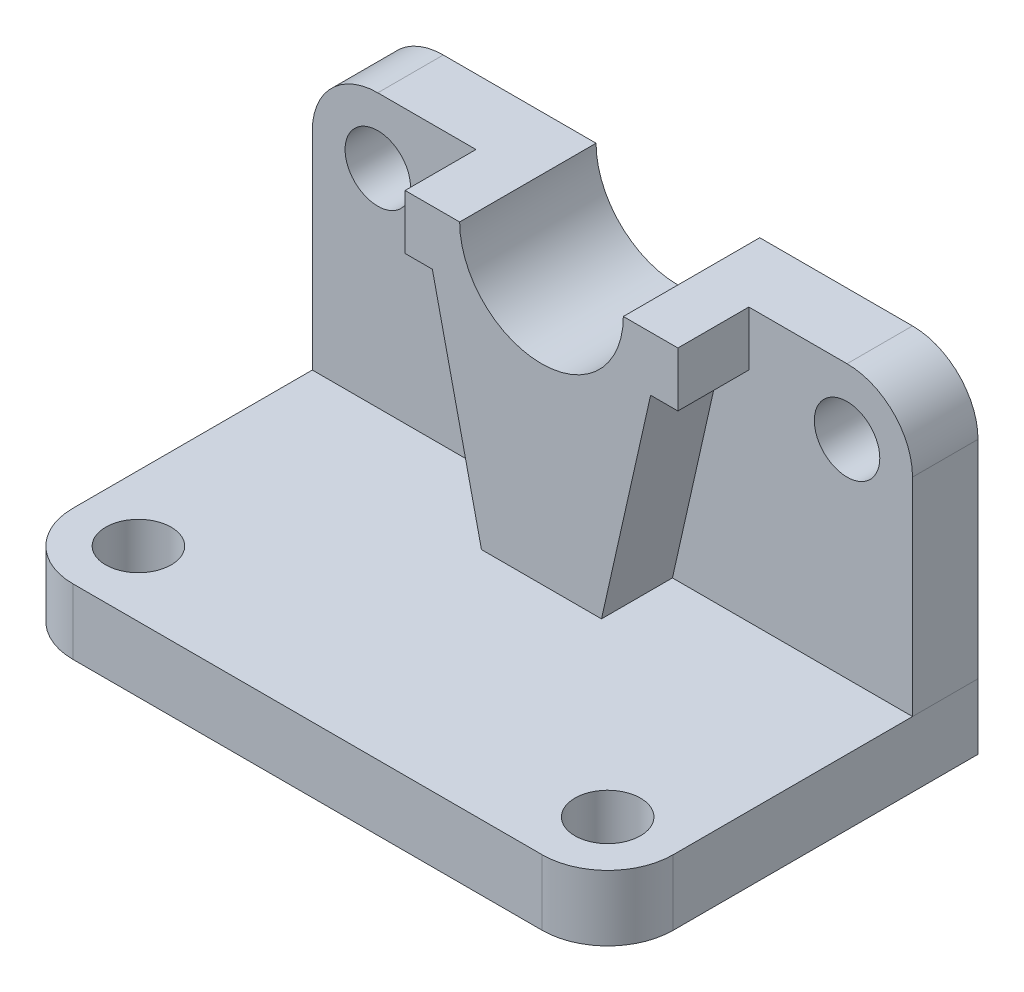
ISO-10303-21;
HEADER;
FILE_DESCRIPTION(('STEP AP214'),'2;1');
FILE_NAME('part.step','',(''),(''),'','','');
FILE_SCHEMA(('AUTOMOTIVE_DESIGN { 1 0 10303 214 1 1 1 1 }'));
ENDSEC;
DATA;
#1=APPLICATION_CONTEXT('core data for automotive mechanical design processes');
#2=APPLICATION_PROTOCOL_DEFINITION('international standard','automotive_design',2000,#1);
#3=PRODUCT_CONTEXT('',#1,'mechanical');
#4=PRODUCT('Part','Part','',(#3));
#5=PRODUCT_RELATED_PRODUCT_CATEGORY('part','',(#4));
#6=PRODUCT_DEFINITION_FORMATION('','',#4);
#7=PRODUCT_DEFINITION_CONTEXT('part definition',#1,'design');
#8=PRODUCT_DEFINITION('design','',#6,#7);
#9=PRODUCT_DEFINITION_SHAPE('','',#8);
#10=(LENGTH_UNIT() NAMED_UNIT(*) SI_UNIT(.MILLI.,.METRE.));
#11=(NAMED_UNIT(*) PLANE_ANGLE_UNIT() SI_UNIT($,.RADIAN.));
#12=(NAMED_UNIT(*) SI_UNIT($,.STERADIAN.) SOLID_ANGLE_UNIT());
#13=UNCERTAINTY_MEASURE_WITH_UNIT(LENGTH_MEASURE(1.E-05),#10,'distance_accuracy_value','');
#14=(GEOMETRIC_REPRESENTATION_CONTEXT(3) GLOBAL_UNCERTAINTY_ASSIGNED_CONTEXT((#13)) GLOBAL_UNIT_ASSIGNED_CONTEXT((#10,
#11,#12)) REPRESENTATION_CONTEXT('',''));
#15=CARTESIAN_POINT('',(0.,0.,0.));
#16=DIRECTION('',(0.,0.,1.));
#17=DIRECTION('',(1.,0.,0.));
#18=AXIS2_PLACEMENT_3D('',#15,#16,#17);
#19=CARTESIAN_POINT('',(0.,62.,12.));
#20=DIRECTION('',(0.,1.,0.));
#21=DIRECTION('',(0.,0.,1.));
#22=AXIS2_PLACEMENT_3D('',#19,#20,#21);
#23=PLANE('',#22);
#24=DIRECTION('',(1.,0.,0.));
#25=VECTOR('',#24,1.);
#26=CARTESIAN_POINT('',(0.,62.,0.));
#27=LINE('',#26,#25);
#28=CARTESIAN_POINT('',(-98.,62.,0.));
#29=VERTEX_POINT('',#28);
#30=CARTESIAN_POINT('',(-70.,62.,0.));
#31=VERTEX_POINT('',#30);
#32=EDGE_CURVE('E318',#29,#31,#27,.T.);
#33=ORIENTED_EDGE('',*,*,#32,.F.);
#34=DIRECTION('',(0.,0.,-1.));
#35=VECTOR('',#34,1.);
#36=CARTESIAN_POINT('',(-98.,62.,12.));
#37=LINE('',#36,#35);
#38=CARTESIAN_POINT('',(-98.,62.,12.));
#39=VERTEX_POINT('',#38);
#40=EDGE_CURVE('E13',#39,#29,#37,.T.);
#41=ORIENTED_EDGE('',*,*,#40,.F.);
#42=DIRECTION('',(1.,0.,0.));
#43=VECTOR('',#42,1.);
#44=CARTESIAN_POINT('',(0.,62.,12.));
#45=LINE('',#44,#43);
#46=CARTESIAN_POINT('',(-80.,62.,12.));
#47=VERTEX_POINT('',#46);
#48=EDGE_CURVE('E301',#39,#47,#45,.T.);
#49=ORIENTED_EDGE('',*,*,#48,.T.);
#50=DIRECTION('',(0.,0.,-1.));
#51=VECTOR('',#50,1.);
#52=CARTESIAN_POINT('',(-80.,62.,25.));
#53=LINE('',#52,#51);
#54=CARTESIAN_POINT('',(-80.,62.,25.));
#55=VERTEX_POINT('',#54);
#56=EDGE_CURVE('E292',#55,#47,#53,.T.);
#57=ORIENTED_EDGE('',*,*,#56,.F.);
#58=DIRECTION('',(1.,0.,0.));
#59=VECTOR('',#58,1.);
#60=CARTESIAN_POINT('',(0.,62.,25.));
#61=LINE('',#60,#59);
#62=CARTESIAN_POINT('',(-70.,62.,25.));
#63=VERTEX_POINT('',#62);
#64=EDGE_CURVE('E248',#55,#63,#61,.T.);
#65=ORIENTED_EDGE('',*,*,#64,.T.);
#66=DIRECTION('',(0.,0.,-1.));
#67=VECTOR('',#66,1.);
#68=CARTESIAN_POINT('',(-70.,62.,25.));
#69=LINE('',#68,#67);
#70=EDGE_CURVE('E294',#63,#31,#69,.T.);
#71=ORIENTED_EDGE('',*,*,#70,.T.);
#72=EDGE_LOOP('',(#33,#41,#49,#57,#65,#71));
#73=FACE_BOUND('',#72,.T.);
#74=ADVANCED_FACE('F93',(#73),#23,.T.);
#75=CARTESIAN_POINT('',(-98.,50.,12.));
#76=DIRECTION('',(0.,0.,-1.));
#77=DIRECTION('',(-1.,0.,0.));
#78=AXIS2_PLACEMENT_3D('',#75,#76,#77);
#79=CYLINDRICAL_SURFACE('',#78,12.);
#80=CARTESIAN_POINT('',(-98.,50.,0.));
#81=DIRECTION('',(0.,0.,1.));
#82=DIRECTION('',(1.,0.,0.));
#83=AXIS2_PLACEMENT_3D('',#80,#81,#82);
#84=CIRCLE('',#83,12.);
#85=CARTESIAN_POINT('',(-110.,50.,0.));
#86=VERTEX_POINT('',#85);
#87=EDGE_CURVE('E320',#29,#86,#84,.T.);
#88=ORIENTED_EDGE('',*,*,#87,.T.);
#89=DIRECTION('',(0.,0.,-1.));
#90=VECTOR('',#89,1.);
#91=CARTESIAN_POINT('',(-110.,50.,12.));
#92=LINE('',#91,#90);
#93=CARTESIAN_POINT('',(-110.,50.,12.));
#94=VERTEX_POINT('',#93);
#95=EDGE_CURVE('E102',#94,#86,#92,.T.);
#96=ORIENTED_EDGE('',*,*,#95,.F.);
#97=CARTESIAN_POINT('',(-98.,50.,12.));
#98=DIRECTION('',(0.,0.,1.));
#99=DIRECTION('',(1.,0.,0.));
#100=AXIS2_PLACEMENT_3D('',#97,#98,#99);
#101=CIRCLE('',#100,12.);
#102=EDGE_CURVE('E304',#39,#94,#101,.T.);
#103=ORIENTED_EDGE('',*,*,#102,.F.);
#104=ORIENTED_EDGE('',*,*,#40,.T.);
#105=EDGE_LOOP('',(#88,#96,#103,#104));
#106=FACE_BOUND('',#105,.T.);
#107=ADVANCED_FACE('F364',(#106),#79,.T.);
#108=CARTESIAN_POINT('',(-110.,0.,12.));
#109=DIRECTION('',(-1.,0.,0.));
#110=DIRECTION('',(0.,0.,1.));
#111=AXIS2_PLACEMENT_3D('',#108,#109,#110);
#112=PLANE('',#111);
#113=DIRECTION('',(0.,1.,0.));
#114=VECTOR('',#113,1.);
#115=CARTESIAN_POINT('',(-110.,0.,0.));
#116=LINE('',#115,#114);
#117=CARTESIAN_POINT('',(-110.,12.,0.));
#118=VERTEX_POINT('',#117);
#119=EDGE_CURVE('E322',#118,#86,#116,.T.);
#120=ORIENTED_EDGE('',*,*,#119,.F.);
#121=DIRECTION('',(0.,0.,-1.));
#122=VECTOR('',#121,1.);
#123=CARTESIAN_POINT('',(-110.,12.,12.));
#124=LINE('',#123,#122);
#125=CARTESIAN_POINT('',(-110.,12.,12.));
#126=VERTEX_POINT('',#125);
#127=EDGE_CURVE('E110',#126,#118,#124,.T.);
#128=ORIENTED_EDGE('',*,*,#127,.F.);
#129=DIRECTION('',(0.,1.,0.));
#130=VECTOR('',#129,1.);
#131=CARTESIAN_POINT('',(-110.,0.,12.));
#132=LINE('',#131,#130);
#133=EDGE_CURVE('E306',#126,#94,#132,.T.);
#134=ORIENTED_EDGE('',*,*,#133,.T.);
#135=ORIENTED_EDGE('',*,*,#95,.T.);
#136=EDGE_LOOP('',(#120,#128,#134,#135));
#137=FACE_BOUND('',#136,.T.);
#138=ADVANCED_FACE('F370',(#137),#112,.T.);
#139=CARTESIAN_POINT('',(0.,12.,12.));
#140=DIRECTION('',(0.,-1.,0.));
#141=DIRECTION('',(0.,0.,-1.));
#142=AXIS2_PLACEMENT_3D('',#139,#140,#141);
#143=PLANE('',#142);
#144=DIRECTION('',(-1.,0.,0.));
#145=VECTOR('',#144,1.);
#146=CARTESIAN_POINT('',(0.,12.,0.));
#147=LINE('',#146,#145);
#148=CARTESIAN_POINT('',(0.,12.,0.));
#149=VERTEX_POINT('',#148);
#150=EDGE_CURVE('E302',#149,#118,#147,.T.);
#151=ORIENTED_EDGE('',*,*,#150,.F.);
#152=DIRECTION('',(0.,0.,-1.));
#153=VECTOR('',#152,1.);
#154=CARTESIAN_POINT('',(0.,12.,12.));
#155=LINE('',#154,#153);
#156=CARTESIAN_POINT('',(0.,12.,12.));
#157=VERTEX_POINT('',#156);
#158=EDGE_CURVE('E241',#157,#149,#155,.T.);
#159=ORIENTED_EDGE('',*,*,#158,.F.);
#160=DIRECTION('',(1.,0.,0.));
#161=VECTOR('',#160,1.);
#162=CARTESIAN_POINT('',(0.,12.,12.));
#163=LINE('',#162,#161);
#164=CARTESIAN_POINT('',(-44.,12.,12.));
#165=VERTEX_POINT('',#164);
#166=EDGE_CURVE('E227',#165,#157,#163,.T.);
#167=ORIENTED_EDGE('',*,*,#166,.F.);
#168=DIRECTION('',(0.,0.,-1.));
#169=VECTOR('',#168,1.);
#170=CARTESIAN_POINT('',(-44.,12.,25.));
#171=LINE('',#170,#169);
#172=CARTESIAN_POINT('',(-44.,12.,25.));
#173=VERTEX_POINT('',#172);
#174=EDGE_CURVE('E280',#173,#165,#171,.T.);
#175=ORIENTED_EDGE('',*,*,#174,.F.);
#176=DIRECTION('',(1.,0.,0.));
#177=VECTOR('',#176,1.);
#178=CARTESIAN_POINT('',(0.,12.,25.));
#179=LINE('',#178,#177);
#180=CARTESIAN_POINT('',(-66.,12.,25.));
#181=VERTEX_POINT('',#180);
#182=EDGE_CURVE('E257',#181,#173,#179,.T.);
#183=ORIENTED_EDGE('',*,*,#182,.F.);
#184=DIRECTION('',(0.,0.,-1.));
#185=VECTOR('',#184,1.);
#186=CARTESIAN_POINT('',(-66.,12.,25.));
#187=LINE('',#186,#185);
#188=CARTESIAN_POINT('',(-66.,12.,12.));
#189=VERTEX_POINT('',#188);
#190=EDGE_CURVE('E283',#181,#189,#187,.T.);
#191=ORIENTED_EDGE('',*,*,#190,.T.);
#192=DIRECTION('',(-1.,0.,0.));
#193=VECTOR('',#192,1.);
#194=CARTESIAN_POINT('',(0.,12.,12.));
#195=LINE('',#194,#193);
#196=EDGE_CURVE('E308',#189,#126,#195,.T.);
#197=ORIENTED_EDGE('',*,*,#196,.T.);
#198=ORIENTED_EDGE('',*,*,#127,.T.);
#199=EDGE_LOOP('',(#151,#159,#167,#175,#183,#191,#197,#198));
#200=FACE_BOUND('',#199,.T.);
#201=ADVANCED_FACE('F331',(#200),#143,.T.);
#202=CARTESIAN_POINT('',(-98.,50.,12.));
#203=DIRECTION('',(0.,0.,-1.));
#204=DIRECTION('',(-1.,0.,0.));
#205=AXIS2_PLACEMENT_3D('',#202,#203,#204);
#206=CYLINDRICAL_SURFACE('',#205,6.);
#207=CARTESIAN_POINT('',(-98.,50.,12.));
#208=DIRECTION('',(0.,0.,1.));
#209=DIRECTION('',(1.,0.,0.));
#210=AXIS2_PLACEMENT_3D('',#207,#208,#209);
#211=CIRCLE('',#210,6.);
#212=CARTESIAN_POINT('',(-92.,50.,12.));
#213=VERTEX_POINT('',#212);
#214=EDGE_CURVE('E298',#213,#213,#211,.T.);
#215=ORIENTED_EDGE('',*,*,#214,.T.);
#216=EDGE_LOOP('',(#215));
#217=FACE_BOUND('',#216,.T.);
#218=CARTESIAN_POINT('',(-98.,50.,0.));
#219=DIRECTION('',(0.,0.,1.));
#220=DIRECTION('',(1.,0.,0.));
#221=AXIS2_PLACEMENT_3D('',#218,#219,#220);
#222=CIRCLE('',#221,6.);
#223=CARTESIAN_POINT('',(-92.,50.,0.));
#224=VERTEX_POINT('',#223);
#225=EDGE_CURVE('E297',#224,#224,#222,.T.);
#226=ORIENTED_EDGE('',*,*,#225,.F.);
#227=EDGE_LOOP('',(#226));
#228=FACE_BOUND('',#227,.T.);
#229=ADVANCED_FACE('F95',(#217,#228),#206,.F.);
#230=CARTESIAN_POINT('',(0.,0.,12.));
#231=DIRECTION('',(0.,0.,1.));
#232=DIRECTION('',(1.,0.,0.));
#233=AXIS2_PLACEMENT_3D('',#230,#231,#232);
#234=PLANE('',#233);
#235=ORIENTED_EDGE('',*,*,#214,.F.);
#236=EDGE_LOOP('',(#235));
#237=FACE_BOUND('',#236,.T.);
#238=ORIENTED_EDGE('',*,*,#48,.F.);
#239=ORIENTED_EDGE('',*,*,#102,.T.);
#240=ORIENTED_EDGE('',*,*,#133,.F.);
#241=ORIENTED_EDGE('',*,*,#196,.F.);
#242=DIRECTION('',(0.219512195121952,-0.975609756097561,0.));
#243=VECTOR('',#242,1.);
#244=CARTESIAN_POINT('',(-60.2498512790006,-13.5562165377752,12.));
#245=LINE('',#244,#243);
#246=CARTESIAN_POINT('',(-75.,52.,12.));
#247=VERTEX_POINT('',#246);
#248=EDGE_CURVE('E310',#247,#189,#245,.T.);
#249=ORIENTED_EDGE('',*,*,#248,.F.);
#250=DIRECTION('',(1.,0.,0.));
#251=VECTOR('',#250,1.);
#252=CARTESIAN_POINT('',(0.,52.,12.));
#253=LINE('',#252,#251);
#254=CARTESIAN_POINT('',(-80.,52.,12.));
#255=VERTEX_POINT('',#254);
#256=EDGE_CURVE('E312',#255,#247,#253,.T.);
#257=ORIENTED_EDGE('',*,*,#256,.F.);
#258=DIRECTION('',(0.,-1.,0.));
#259=VECTOR('',#258,1.);
#260=CARTESIAN_POINT('',(-80.,0.,12.));
#261=LINE('',#260,#259);
#262=EDGE_CURVE('E314',#47,#255,#261,.T.);
#263=ORIENTED_EDGE('',*,*,#262,.F.);
#264=EDGE_LOOP('',(#238,#239,#240,#241,#249,#257,#263));
#265=FACE_BOUND('',#264,.T.);
#266=ADVANCED_FACE('F380',(#237,#265),#234,.T.);
#267=CARTESIAN_POINT('',(0.,0.,0.));
#268=DIRECTION('',(0.,0.,1.));
#269=DIRECTION('',(1.,0.,0.));
#270=AXIS2_PLACEMENT_3D('',#267,#268,#269);
#271=PLANE('',#270);
#272=ORIENTED_EDGE('',*,*,#225,.T.);
#273=EDGE_LOOP('',(#272));
#274=FACE_BOUND('',#273,.T.);
#275=ORIENTED_EDGE('',*,*,#32,.T.);
#276=CARTESIAN_POINT('',(-55.,62.,0.));
#277=DIRECTION('',(0.,0.,1.));
#278=DIRECTION('',(1.,0.,0.));
#279=AXIS2_PLACEMENT_3D('',#276,#277,#278);
#280=CIRCLE('',#279,15.);
#281=CARTESIAN_POINT('',(-40.,62.,0.));
#282=VERTEX_POINT('',#281);
#283=EDGE_CURVE('E236',#31,#282,#280,.T.);
#284=ORIENTED_EDGE('',*,*,#283,.T.);
#285=DIRECTION('',(1.,0.,0.));
#286=VECTOR('',#285,1.);
#287=CARTESIAN_POINT('',(0.,62.,0.));
#288=LINE('',#287,#286);
#289=CARTESIAN_POINT('',(-12.,62.,0.));
#290=VERTEX_POINT('',#289);
#291=EDGE_CURVE('E239',#282,#290,#288,.T.);
#292=ORIENTED_EDGE('',*,*,#291,.T.);
#293=CARTESIAN_POINT('',(-12.,50.,0.));
#294=DIRECTION('',(0.,0.,1.));
#295=DIRECTION('',(1.,0.,0.));
#296=AXIS2_PLACEMENT_3D('',#293,#294,#295);
#297=CIRCLE('',#296,12.);
#298=CARTESIAN_POINT('',(0.,50.,0.));
#299=VERTEX_POINT('',#298);
#300=EDGE_CURVE('E335',#299,#290,#297,.T.);
#301=ORIENTED_EDGE('',*,*,#300,.F.);
#302=DIRECTION('',(0.,1.,0.));
#303=VECTOR('',#302,1.);
#304=CARTESIAN_POINT('',(0.,0.,0.));
#305=LINE('',#304,#303);
#306=EDGE_CURVE('E235',#149,#299,#305,.T.);
#307=ORIENTED_EDGE('',*,*,#306,.F.);
#308=ORIENTED_EDGE('',*,*,#150,.T.);
#309=ORIENTED_EDGE('',*,*,#119,.T.);
#310=ORIENTED_EDGE('',*,*,#87,.F.);
#311=EDGE_LOOP('',(#275,#284,#292,#301,#307,#308,#309,#310));
#312=FACE_BOUND('',#311,.T.);
#313=CARTESIAN_POINT('',(-12.,50.,0.));
#314=DIRECTION('',(0.,0.,1.));
#315=DIRECTION('',(1.,0.,0.));
#316=AXIS2_PLACEMENT_3D('',#313,#314,#315);
#317=CIRCLE('',#316,6.);
#318=CARTESIAN_POINT('',(-6.,50.,0.));
#319=VERTEX_POINT('',#318);
#320=EDGE_CURVE('E338',#319,#319,#317,.T.);
#321=ORIENTED_EDGE('',*,*,#320,.T.);
#322=EDGE_LOOP('',(#321));
#323=FACE_BOUND('',#322,.T.);
#324=ADVANCED_FACE('F328',(#274,#312,#323),#271,.F.);
#325=CARTESIAN_POINT('',(-55.,62.,25.));
#326=DIRECTION('',(0.,0.,-1.));
#327=DIRECTION('',(-1.,0.,0.));
#328=AXIS2_PLACEMENT_3D('',#325,#326,#327);
#329=CYLINDRICAL_SURFACE('',#328,15.);
#330=ORIENTED_EDGE('',*,*,#283,.F.);
#331=ORIENTED_EDGE('',*,*,#70,.F.);
#332=CARTESIAN_POINT('',(-55.,62.,25.));
#333=DIRECTION('',(0.,0.,1.));
#334=DIRECTION('',(1.,0.,0.));
#335=AXIS2_PLACEMENT_3D('',#332,#333,#334);
#336=CIRCLE('',#335,15.);
#337=CARTESIAN_POINT('',(-40.,62.,25.));
#338=VERTEX_POINT('',#337);
#339=EDGE_CURVE('E245',#63,#338,#336,.T.);
#340=ORIENTED_EDGE('',*,*,#339,.T.);
#341=DIRECTION('',(0.,0.,-1.));
#342=VECTOR('',#341,1.);
#343=CARTESIAN_POINT('',(-40.,62.,25.));
#344=LINE('',#343,#342);
#345=EDGE_CURVE('E267',#338,#282,#344,.T.);
#346=ORIENTED_EDGE('',*,*,#345,.T.);
#347=EDGE_LOOP('',(#330,#331,#340,#346));
#348=FACE_BOUND('',#347,.T.);
#349=ADVANCED_FACE('F379',(#348),#329,.F.);
#350=CARTESIAN_POINT('',(-80.,0.,25.));
#351=DIRECTION('',(1.,0.,0.));
#352=DIRECTION('',(0.,0.,-1.));
#353=AXIS2_PLACEMENT_3D('',#350,#351,#352);
#354=PLANE('',#353);
#355=ORIENTED_EDGE('',*,*,#262,.T.);
#356=DIRECTION('',(0.,0.,-1.));
#357=VECTOR('',#356,1.);
#358=CARTESIAN_POINT('',(-80.,52.,25.));
#359=LINE('',#358,#357);
#360=CARTESIAN_POINT('',(-80.,52.,25.));
#361=VERTEX_POINT('',#360);
#362=EDGE_CURVE('E289',#361,#255,#359,.T.);
#363=ORIENTED_EDGE('',*,*,#362,.F.);
#364=DIRECTION('',(0.,-1.,0.));
#365=VECTOR('',#364,1.);
#366=CARTESIAN_POINT('',(-80.,0.,25.));
#367=LINE('',#366,#365);
#368=EDGE_CURVE('E251',#55,#361,#367,.T.);
#369=ORIENTED_EDGE('',*,*,#368,.F.);
#370=ORIENTED_EDGE('',*,*,#56,.T.);
#371=EDGE_LOOP('',(#355,#363,#369,#370));
#372=FACE_BOUND('',#371,.T.);
#373=ADVANCED_FACE('F387',(#372),#354,.F.);
#374=CARTESIAN_POINT('',(0.,52.,25.));
#375=DIRECTION('',(0.,1.,0.));
#376=DIRECTION('',(0.,0.,1.));
#377=AXIS2_PLACEMENT_3D('',#374,#375,#376);
#378=PLANE('',#377);
#379=ORIENTED_EDGE('',*,*,#256,.T.);
#380=DIRECTION('',(0.,0.,-1.));
#381=VECTOR('',#380,1.);
#382=CARTESIAN_POINT('',(-75.,52.,25.));
#383=LINE('',#382,#381);
#384=CARTESIAN_POINT('',(-75.,52.,25.));
#385=VERTEX_POINT('',#384);
#386=EDGE_CURVE('E286',#385,#247,#383,.T.);
#387=ORIENTED_EDGE('',*,*,#386,.F.);
#388=DIRECTION('',(1.,0.,0.));
#389=VECTOR('',#388,1.);
#390=CARTESIAN_POINT('',(0.,52.,25.));
#391=LINE('',#390,#389);
#392=EDGE_CURVE('E253',#361,#385,#391,.T.);
#393=ORIENTED_EDGE('',*,*,#392,.F.);
#394=ORIENTED_EDGE('',*,*,#362,.T.);
#395=EDGE_LOOP('',(#379,#387,#393,#394));
#396=FACE_BOUND('',#395,.T.);
#397=ADVANCED_FACE('F391',(#396),#378,.F.);
#398=CARTESIAN_POINT('',(-60.2498512790006,-13.5562165377752,25.));
#399=DIRECTION('',(0.975609756097561,0.219512195121952,0.));
#400=DIRECTION('',(-0.219512195121952,0.975609756097561,0.));
#401=AXIS2_PLACEMENT_3D('',#398,#399,#400);
#402=PLANE('',#401);
#403=ORIENTED_EDGE('',*,*,#248,.T.);
#404=ORIENTED_EDGE('',*,*,#190,.F.);
#405=DIRECTION('',(0.219512195121952,-0.975609756097561,0.));
#406=VECTOR('',#405,1.);
#407=CARTESIAN_POINT('',(-60.2498512790006,-13.5562165377752,25.));
#408=LINE('',#407,#406);
#409=EDGE_CURVE('E255',#385,#181,#408,.T.);
#410=ORIENTED_EDGE('',*,*,#409,.F.);
#411=ORIENTED_EDGE('',*,*,#386,.T.);
#412=EDGE_LOOP('',(#403,#404,#410,#411));
#413=FACE_BOUND('',#412,.T.);
#414=ADVANCED_FACE('F395',(#413),#402,.F.);
#415=CARTESIAN_POINT('',(-44.4497323022011,10.0011897679952,25.));
#416=DIRECTION('',(-0.975609756097561,0.219512195121951,0.));
#417=DIRECTION('',(-0.219512195121951,-0.975609756097561,0.));
#418=AXIS2_PLACEMENT_3D('',#415,#416,#417);
#419=PLANE('',#418);
#420=ORIENTED_EDGE('',*,*,#174,.T.);
#421=DIRECTION('',(0.219512195121951,0.975609756097561,0.));
#422=VECTOR('',#421,1.);
#423=CARTESIAN_POINT('',(-44.4497323022011,10.0011897679952,12.));
#424=LINE('',#423,#422);
#425=CARTESIAN_POINT('',(-35.,52.,12.));
#426=VERTEX_POINT('',#425);
#427=EDGE_CURVE('E332',#165,#426,#424,.T.);
#428=ORIENTED_EDGE('',*,*,#427,.T.);
#429=DIRECTION('',(0.,0.,-1.));
#430=VECTOR('',#429,1.);
#431=CARTESIAN_POINT('',(-35.,52.,25.));
#432=LINE('',#431,#430);
#433=CARTESIAN_POINT('',(-35.,52.,25.));
#434=VERTEX_POINT('',#433);
#435=EDGE_CURVE('E277',#434,#426,#432,.T.);
#436=ORIENTED_EDGE('',*,*,#435,.F.);
#437=DIRECTION('',(0.219512195121951,0.975609756097561,0.));
#438=VECTOR('',#437,1.);
#439=CARTESIAN_POINT('',(-44.4497323022011,10.0011897679952,25.));
#440=LINE('',#439,#438);
#441=EDGE_CURVE('E259',#173,#434,#440,.T.);
#442=ORIENTED_EDGE('',*,*,#441,.F.);
#443=EDGE_LOOP('',(#420,#428,#436,#442));
#444=FACE_BOUND('',#443,.T.);
#445=ADVANCED_FACE('F399',(#444),#419,.F.);
#446=CARTESIAN_POINT('',(0.,52.,25.));
#447=DIRECTION('',(0.,1.,0.));
#448=DIRECTION('',(0.,0.,1.));
#449=AXIS2_PLACEMENT_3D('',#446,#447,#448);
#450=PLANE('',#449);
#451=ORIENTED_EDGE('',*,*,#435,.T.);
#452=DIRECTION('',(1.,0.,0.));
#453=VECTOR('',#452,1.);
#454=CARTESIAN_POINT('',(0.,52.,12.));
#455=LINE('',#454,#453);
#456=CARTESIAN_POINT('',(-30.,52.,12.));
#457=VERTEX_POINT('',#456);
#458=EDGE_CURVE('E343',#426,#457,#455,.T.);
#459=ORIENTED_EDGE('',*,*,#458,.T.);
#460=DIRECTION('',(0.,0.,-1.));
#461=VECTOR('',#460,1.);
#462=CARTESIAN_POINT('',(-30.,52.,25.));
#463=LINE('',#462,#461);
#464=CARTESIAN_POINT('',(-30.,52.,25.));
#465=VERTEX_POINT('',#464);
#466=EDGE_CURVE('E274',#465,#457,#463,.T.);
#467=ORIENTED_EDGE('',*,*,#466,.F.);
#468=DIRECTION('',(1.,0.,0.));
#469=VECTOR('',#468,1.);
#470=CARTESIAN_POINT('',(0.,52.,25.));
#471=LINE('',#470,#469);
#472=EDGE_CURVE('E261',#434,#465,#471,.T.);
#473=ORIENTED_EDGE('',*,*,#472,.F.);
#474=EDGE_LOOP('',(#451,#459,#467,#473));
#475=FACE_BOUND('',#474,.T.);
#476=ADVANCED_FACE('F403',(#475),#450,.F.);
#477=CARTESIAN_POINT('',(-30.,0.,25.));
#478=DIRECTION('',(-1.,0.,0.));
#479=DIRECTION('',(0.,0.,1.));
#480=AXIS2_PLACEMENT_3D('',#477,#478,#479);
#481=PLANE('',#480);
#482=ORIENTED_EDGE('',*,*,#466,.T.);
#483=DIRECTION('',(0.,1.,0.));
#484=VECTOR('',#483,1.);
#485=CARTESIAN_POINT('',(-30.,0.,12.));
#486=LINE('',#485,#484);
#487=CARTESIAN_POINT('',(-30.,62.,12.));
#488=VERTEX_POINT('',#487);
#489=EDGE_CURVE('E346',#457,#488,#486,.T.);
#490=ORIENTED_EDGE('',*,*,#489,.T.);
#491=DIRECTION('',(0.,0.,-1.));
#492=VECTOR('',#491,1.);
#493=CARTESIAN_POINT('',(-30.,62.,25.));
#494=LINE('',#493,#492);
#495=CARTESIAN_POINT('',(-30.,62.,25.));
#496=VERTEX_POINT('',#495);
#497=EDGE_CURVE('E271',#496,#488,#494,.T.);
#498=ORIENTED_EDGE('',*,*,#497,.F.);
#499=DIRECTION('',(0.,1.,0.));
#500=VECTOR('',#499,1.);
#501=CARTESIAN_POINT('',(-30.,0.,25.));
#502=LINE('',#501,#500);
#503=EDGE_CURVE('E263',#465,#496,#502,.T.);
#504=ORIENTED_EDGE('',*,*,#503,.F.);
#505=EDGE_LOOP('',(#482,#490,#498,#504));
#506=FACE_BOUND('',#505,.T.);
#507=ADVANCED_FACE('F407',(#506),#481,.F.);
#508=CARTESIAN_POINT('',(0.,62.,25.));
#509=DIRECTION('',(0.,1.,0.));
#510=DIRECTION('',(-1.,0.,0.));
#511=AXIS2_PLACEMENT_3D('',#508,#509,#510);
#512=PLANE('',#511);
#513=ORIENTED_EDGE('',*,*,#291,.F.);
#514=ORIENTED_EDGE('',*,*,#345,.F.);
#515=DIRECTION('',(1.,0.,0.));
#516=VECTOR('',#515,1.);
#517=CARTESIAN_POINT('',(0.,62.,25.));
#518=LINE('',#517,#516);
#519=EDGE_CURVE('E265',#338,#496,#518,.T.);
#520=ORIENTED_EDGE('',*,*,#519,.T.);
#521=ORIENTED_EDGE('',*,*,#497,.T.);
#522=DIRECTION('',(1.,0.,0.));
#523=VECTOR('',#522,1.);
#524=CARTESIAN_POINT('',(0.,62.,12.));
#525=LINE('',#524,#523);
#526=CARTESIAN_POINT('',(-12.,62.,12.));
#527=VERTEX_POINT('',#526);
#528=EDGE_CURVE('E221',#488,#527,#525,.T.);
#529=ORIENTED_EDGE('',*,*,#528,.T.);
#530=DIRECTION('',(0.,0.,-1.));
#531=VECTOR('',#530,1.);
#532=CARTESIAN_POINT('',(-12.,62.,12.));
#533=LINE('',#532,#531);
#534=EDGE_CURVE('E218',#527,#290,#533,.T.);
#535=ORIENTED_EDGE('',*,*,#534,.T.);
#536=EDGE_LOOP('',(#513,#514,#520,#521,#529,#535));
#537=FACE_BOUND('',#536,.T.);
#538=ADVANCED_FACE('F411',(#537),#512,.T.);
#539=CARTESIAN_POINT('',(0.,0.,25.));
#540=DIRECTION('',(0.,0.,1.));
#541=DIRECTION('',(1.,0.,0.));
#542=AXIS2_PLACEMENT_3D('',#539,#540,#541);
#543=PLANE('',#542);
#544=ORIENTED_EDGE('',*,*,#339,.F.);
#545=ORIENTED_EDGE('',*,*,#64,.F.);
#546=ORIENTED_EDGE('',*,*,#368,.T.);
#547=ORIENTED_EDGE('',*,*,#392,.T.);
#548=ORIENTED_EDGE('',*,*,#409,.T.);
#549=ORIENTED_EDGE('',*,*,#182,.T.);
#550=ORIENTED_EDGE('',*,*,#441,.T.);
#551=ORIENTED_EDGE('',*,*,#472,.T.);
#552=ORIENTED_EDGE('',*,*,#503,.T.);
#553=ORIENTED_EDGE('',*,*,#519,.F.);
#554=EDGE_LOOP('',(#544,#545,#546,#547,#548,#549,#550,#551,#552,#553));
#555=FACE_BOUND('',#554,.T.);
#556=ADVANCED_FACE('F415',(#555),#543,.T.);
#557=CARTESIAN_POINT('',(0.,0.,12.));
#558=DIRECTION('',(-1.,0.,0.));
#559=DIRECTION('',(0.,0.,1.));
#560=AXIS2_PLACEMENT_3D('',#557,#558,#559);
#561=PLANE('',#560);
#562=ORIENTED_EDGE('',*,*,#306,.T.);
#563=DIRECTION('',(0.,0.,-1.));
#564=VECTOR('',#563,1.);
#565=CARTESIAN_POINT('',(0.,50.,12.));
#566=LINE('',#565,#564);
#567=CARTESIAN_POINT('',(0.,50.,12.));
#568=VERTEX_POINT('',#567);
#569=EDGE_CURVE('E215',#568,#299,#566,.T.);
#570=ORIENTED_EDGE('',*,*,#569,.F.);
#571=DIRECTION('',(0.,1.,0.));
#572=VECTOR('',#571,1.);
#573=CARTESIAN_POINT('',(0.,0.,12.));
#574=LINE('',#573,#572);
#575=EDGE_CURVE('E222',#157,#568,#574,.T.);
#576=ORIENTED_EDGE('',*,*,#575,.F.);
#577=ORIENTED_EDGE('',*,*,#158,.T.);
#578=EDGE_LOOP('',(#562,#570,#576,#577));
#579=FACE_BOUND('',#578,.T.);
#580=ADVANCED_FACE('F233',(#579),#561,.F.);
#581=CARTESIAN_POINT('',(-12.,50.,12.));
#582=DIRECTION('',(0.,0.,-1.));
#583=DIRECTION('',(-1.,0.,0.));
#584=AXIS2_PLACEMENT_3D('',#581,#582,#583);
#585=CYLINDRICAL_SURFACE('',#584,12.);
#586=ORIENTED_EDGE('',*,*,#300,.T.);
#587=ORIENTED_EDGE('',*,*,#534,.F.);
#588=CARTESIAN_POINT('',(-12.,50.,12.));
#589=DIRECTION('',(0.,0.,1.));
#590=DIRECTION('',(1.,0.,0.));
#591=AXIS2_PLACEMENT_3D('',#588,#589,#590);
#592=CIRCLE('',#591,12.);
#593=EDGE_CURVE('E210',#568,#527,#592,.T.);
#594=ORIENTED_EDGE('',*,*,#593,.F.);
#595=ORIENTED_EDGE('',*,*,#569,.T.);
#596=EDGE_LOOP('',(#586,#587,#594,#595));
#597=FACE_BOUND('',#596,.T.);
#598=ADVANCED_FACE('F213',(#597),#585,.T.);
#599=CARTESIAN_POINT('',(-12.,50.,12.));
#600=DIRECTION('',(0.,0.,-1.));
#601=DIRECTION('',(-1.,0.,0.));
#602=AXIS2_PLACEMENT_3D('',#599,#600,#601);
#603=CYLINDRICAL_SURFACE('',#602,6.);
#604=CARTESIAN_POINT('',(-12.,50.,12.));
#605=DIRECTION('',(0.,0.,1.));
#606=DIRECTION('',(1.,0.,0.));
#607=AXIS2_PLACEMENT_3D('',#604,#605,#606);
#608=CIRCLE('',#607,6.);
#609=CARTESIAN_POINT('',(-6.,50.,12.));
#610=VERTEX_POINT('',#609);
#611=EDGE_CURVE('E231',#610,#610,#608,.T.);
#612=ORIENTED_EDGE('',*,*,#611,.T.);
#613=EDGE_LOOP('',(#612));
#614=FACE_BOUND('',#613,.T.);
#615=ORIENTED_EDGE('',*,*,#320,.F.);
#616=EDGE_LOOP('',(#615));
#617=FACE_BOUND('',#616,.T.);
#618=ADVANCED_FACE('F353',(#614,#617),#603,.F.);
#619=CARTESIAN_POINT('',(0.,0.,12.));
#620=DIRECTION('',(0.,0.,1.));
#621=DIRECTION('',(1.,0.,0.));
#622=AXIS2_PLACEMENT_3D('',#619,#620,#621);
#623=PLANE('',#622);
#624=ORIENTED_EDGE('',*,*,#611,.F.);
#625=EDGE_LOOP('',(#624));
#626=FACE_BOUND('',#625,.T.);
#627=ORIENTED_EDGE('',*,*,#575,.T.);
#628=ORIENTED_EDGE('',*,*,#593,.T.);
#629=ORIENTED_EDGE('',*,*,#528,.F.);
#630=ORIENTED_EDGE('',*,*,#489,.F.);
#631=ORIENTED_EDGE('',*,*,#458,.F.);
#632=ORIENTED_EDGE('',*,*,#427,.F.);
#633=ORIENTED_EDGE('',*,*,#166,.T.);
#634=EDGE_LOOP('',(#627,#628,#629,#630,#631,#632,#633));
#635=FACE_BOUND('',#634,.T.);
#636=ADVANCED_FACE('F225',(#626,#635),#623,.T.);
#637=CLOSED_SHELL('',(#74,#107,#138,#201,#229,#266,#324,#349,#373,#397,#414,#445,#476,#507,#538,
#556,#580,#598,#618,#636));
#638=MANIFOLD_SOLID_BREP('B2',#637);
#639=CARTESIAN_POINT('',(-98.,12.,55.8683325117226));
#640=DIRECTION('',(0.,1.,0.));
#641=DIRECTION('',(0.,0.,1.));
#642=AXIS2_PLACEMENT_3D('',#639,#640,#641);
#643=PLANE('',#642);
#644=CARTESIAN_POINT('',(-12.,12.,55.8683325117226));
#645=DIRECTION('',(0.,1.,0.));
#646=DIRECTION('',(0.,0.,1.));
#647=AXIS2_PLACEMENT_3D('',#644,#645,#646);
#648=CIRCLE('',#647,6.);
#649=CARTESIAN_POINT('',(-12.,12.,61.8683325117226));
#650=VERTEX_POINT('',#649);
#651=EDGE_CURVE('E676',#650,#650,#648,.T.);
#652=ORIENTED_EDGE('',*,*,#651,.F.);
#653=EDGE_LOOP('',(#652));
#654=FACE_BOUND('',#653,.T.);
#655=CARTESIAN_POINT('',(-98.,12.,55.8683325117226));
#656=DIRECTION('',(0.,1.,0.));
#657=DIRECTION('',(0.,0.,1.));
#658=AXIS2_PLACEMENT_3D('',#655,#656,#657);
#659=CIRCLE('',#658,12.);
#660=CARTESIAN_POINT('',(-110.,12.,55.8683325117226));
#661=VERTEX_POINT('',#660);
#662=CARTESIAN_POINT('',(-98.,12.,67.8683325117226));
#663=VERTEX_POINT('',#662);
#664=EDGE_CURVE('E638',#661,#663,#659,.T.);
#665=ORIENTED_EDGE('',*,*,#664,.T.);
#666=DIRECTION('',(-1.,0.,0.));
#667=VECTOR('',#666,1.);
#668=CARTESIAN_POINT('',(-12.,12.,67.8683325117226));
#669=LINE('',#668,#667);
#670=CARTESIAN_POINT('',(-12.,12.,67.8683325117226));
#671=VERTEX_POINT('',#670);
#672=EDGE_CURVE('E699',#671,#663,#669,.T.);
#673=ORIENTED_EDGE('',*,*,#672,.F.);
#674=CARTESIAN_POINT('',(-12.,12.,55.8683325117226));
#675=DIRECTION('',(0.,1.,0.));
#676=DIRECTION('',(0.,0.,1.));
#677=AXIS2_PLACEMENT_3D('',#674,#675,#676);
#678=CIRCLE('',#677,12.);
#679=CARTESIAN_POINT('',(0.,12.,55.8683325117226));
#680=VERTEX_POINT('',#679);
#681=EDGE_CURVE('E653',#671,#680,#678,.T.);
#682=ORIENTED_EDGE('',*,*,#681,.T.);
#683=DIRECTION('',(0.,0.,-1.));
#684=VECTOR('',#683,1.);
#685=CARTESIAN_POINT('',(0.,12.,55.8683325117226));
#686=LINE('',#685,#684);
#687=CARTESIAN_POINT('',(0.,12.,0.));
#688=VERTEX_POINT('',#687);
#689=EDGE_CURVE('E647',#680,#688,#686,.T.);
#690=ORIENTED_EDGE('',*,*,#689,.T.);
#691=DIRECTION('',(-1.,0.,0.));
#692=VECTOR('',#691,1.);
#693=CARTESIAN_POINT('',(0.,12.,0.));
#694=LINE('',#693,#692);
#695=CARTESIAN_POINT('',(-110.,12.,0.));
#696=VERTEX_POINT('',#695);
#697=EDGE_CURVE('E651',#688,#696,#694,.T.);
#698=ORIENTED_EDGE('',*,*,#697,.T.);
#699=DIRECTION('',(0.,0.,-1.));
#700=VECTOR('',#699,1.);
#701=CARTESIAN_POINT('',(-110.,12.,55.8683325117226));
#702=LINE('',#701,#700);
#703=EDGE_CURVE('E668',#661,#696,#702,.T.);
#704=ORIENTED_EDGE('',*,*,#703,.F.);
#705=EDGE_LOOP('',(#665,#673,#682,#690,#698,#704));
#706=FACE_BOUND('',#705,.T.);
#707=CARTESIAN_POINT('',(-98.,12.,55.8683325117226));
#708=DIRECTION('',(0.,1.,0.));
#709=DIRECTION('',(0.,0.,1.));
#710=AXIS2_PLACEMENT_3D('',#707,#708,#709);
#711=CIRCLE('',#710,6.);
#712=CARTESIAN_POINT('',(-98.,12.,61.8683325117226));
#713=VERTEX_POINT('',#712);
#714=EDGE_CURVE('E728',#713,#713,#711,.T.);
#715=ORIENTED_EDGE('',*,*,#714,.F.);
#716=EDGE_LOOP('',(#715));
#717=FACE_BOUND('',#716,.T.);
#718=ADVANCED_FACE('F589',(#654,#706,#717),#643,.T.);
#719=CARTESIAN_POINT('',(-98.,0.,55.8683325117226));
#720=DIRECTION('',(0.,1.,0.));
#721=DIRECTION('',(0.,0.,1.));
#722=AXIS2_PLACEMENT_3D('',#719,#720,#721);
#723=PLANE('',#722);
#724=CARTESIAN_POINT('',(-98.,0.,55.8683325117226));
#725=DIRECTION('',(0.,1.,0.));
#726=DIRECTION('',(0.,0.,1.));
#727=AXIS2_PLACEMENT_3D('',#724,#725,#726);
#728=CIRCLE('',#727,12.);
#729=CARTESIAN_POINT('',(-110.,0.,55.8683325117226));
#730=VERTEX_POINT('',#729);
#731=CARTESIAN_POINT('',(-98.,0.,67.8683325117226));
#732=VERTEX_POINT('',#731);
#733=EDGE_CURVE('E673',#730,#732,#728,.T.);
#734=ORIENTED_EDGE('',*,*,#733,.F.);
#735=DIRECTION('',(0.,0.,-1.));
#736=VECTOR('',#735,1.);
#737=CARTESIAN_POINT('',(-110.,0.,55.8683325117226));
#738=LINE('',#737,#736);
#739=CARTESIAN_POINT('',(-110.,0.,0.));
#740=VERTEX_POINT('',#739);
#741=EDGE_CURVE('E684',#730,#740,#738,.T.);
#742=ORIENTED_EDGE('',*,*,#741,.T.);
#743=DIRECTION('',(-1.,0.,0.));
#744=VECTOR('',#743,1.);
#745=CARTESIAN_POINT('',(0.,0.,0.));
#746=LINE('',#745,#744);
#747=CARTESIAN_POINT('',(0.,0.,0.));
#748=VERTEX_POINT('',#747);
#749=EDGE_CURVE('E682',#748,#740,#746,.T.);
#750=ORIENTED_EDGE('',*,*,#749,.F.);
#751=DIRECTION('',(0.,0.,-1.));
#752=VECTOR('',#751,1.);
#753=CARTESIAN_POINT('',(0.,0.,55.8683325117226));
#754=LINE('',#753,#752);
#755=CARTESIAN_POINT('',(0.,0.,55.8683325117226));
#756=VERTEX_POINT('',#755);
#757=EDGE_CURVE('E662',#756,#748,#754,.T.);
#758=ORIENTED_EDGE('',*,*,#757,.F.);
#759=CARTESIAN_POINT('',(-12.,0.,55.8683325117226));
#760=DIRECTION('',(0.,1.,0.));
#761=DIRECTION('',(0.,0.,1.));
#762=AXIS2_PLACEMENT_3D('',#759,#760,#761);
#763=CIRCLE('',#762,12.);
#764=CARTESIAN_POINT('',(-12.,0.,67.8683325117226));
#765=VERTEX_POINT('',#764);
#766=EDGE_CURVE('E679',#765,#756,#763,.T.);
#767=ORIENTED_EDGE('',*,*,#766,.F.);
#768=DIRECTION('',(-1.,0.,0.));
#769=VECTOR('',#768,1.);
#770=CARTESIAN_POINT('',(-12.,0.,67.8683325117226));
#771=LINE('',#770,#769);
#772=EDGE_CURVE('E675',#765,#732,#771,.T.);
#773=ORIENTED_EDGE('',*,*,#772,.T.);
#774=EDGE_LOOP('',(#734,#742,#750,#758,#767,#773));
#775=FACE_BOUND('',#774,.T.);
#776=CARTESIAN_POINT('',(-12.,0.,55.8683325117226));
#777=DIRECTION('',(0.,1.,0.));
#778=DIRECTION('',(0.,0.,1.));
#779=AXIS2_PLACEMENT_3D('',#776,#777,#778);
#780=CIRCLE('',#779,6.);
#781=CARTESIAN_POINT('',(-12.,0.,61.8683325117226));
#782=VERTEX_POINT('',#781);
#783=EDGE_CURVE('E734',#782,#782,#780,.T.);
#784=ORIENTED_EDGE('',*,*,#783,.T.);
#785=EDGE_LOOP('',(#784));
#786=FACE_BOUND('',#785,.T.);
#787=CARTESIAN_POINT('',(-98.,0.,55.8683325117226));
#788=DIRECTION('',(0.,1.,0.));
#789=DIRECTION('',(0.,0.,1.));
#790=AXIS2_PLACEMENT_3D('',#787,#788,#789);
#791=CIRCLE('',#790,6.);
#792=CARTESIAN_POINT('',(-98.,0.,61.8683325117226));
#793=VERTEX_POINT('',#792);
#794=EDGE_CURVE('E731',#793,#793,#791,.T.);
#795=ORIENTED_EDGE('',*,*,#794,.T.);
#796=EDGE_LOOP('',(#795));
#797=FACE_BOUND('',#796,.T.);
#798=ADVANCED_FACE('F696',(#775,#786,#797),#723,.F.);
#799=CARTESIAN_POINT('',(-98.,12.,55.8683325117226));
#800=DIRECTION('',(0.,-1.,0.));
#801=DIRECTION('',(0.,0.,-1.));
#802=AXIS2_PLACEMENT_3D('',#799,#800,#801);
#803=CYLINDRICAL_SURFACE('',#802,12.);
#804=ORIENTED_EDGE('',*,*,#733,.T.);
#805=DIRECTION('',(0.,-1.,0.));
#806=VECTOR('',#805,1.);
#807=CARTESIAN_POINT('',(-98.,12.,67.8683325117226));
#808=LINE('',#807,#806);
#809=EDGE_CURVE('E91',#663,#732,#808,.T.);
#810=ORIENTED_EDGE('',*,*,#809,.F.);
#811=ORIENTED_EDGE('',*,*,#664,.F.);
#812=DIRECTION('',(0.,-1.,0.));
#813=VECTOR('',#812,1.);
#814=CARTESIAN_POINT('',(-110.,12.,55.8683325117226));
#815=LINE('',#814,#813);
#816=EDGE_CURVE('E606',#661,#730,#815,.T.);
#817=ORIENTED_EDGE('',*,*,#816,.T.);
#818=EDGE_LOOP('',(#804,#810,#811,#817));
#819=FACE_BOUND('',#818,.T.);
#820=ADVANCED_FACE('F591',(#819),#803,.T.);
#821=CARTESIAN_POINT('',(-12.,12.,67.8683325117226));
#822=DIRECTION('',(0.,0.,1.));
#823=DIRECTION('',(1.,0.,0.));
#824=AXIS2_PLACEMENT_3D('',#821,#822,#823);
#825=PLANE('',#824);
#826=ORIENTED_EDGE('',*,*,#772,.F.);
#827=DIRECTION('',(0.,-1.,0.));
#828=VECTOR('',#827,1.);
#829=CARTESIAN_POINT('',(-12.,12.,67.8683325117226));
#830=LINE('',#829,#828);
#831=EDGE_CURVE('E598',#671,#765,#830,.T.);
#832=ORIENTED_EDGE('',*,*,#831,.F.);
#833=ORIENTED_EDGE('',*,*,#672,.T.);
#834=ORIENTED_EDGE('',*,*,#809,.T.);
#835=EDGE_LOOP('',(#826,#832,#833,#834));
#836=FACE_BOUND('',#835,.T.);
#837=ADVANCED_FACE('F698',(#836),#825,.T.);
#838=CARTESIAN_POINT('',(-12.,12.,55.8683325117226));
#839=DIRECTION('',(0.,-1.,0.));
#840=DIRECTION('',(0.,0.,-1.));
#841=AXIS2_PLACEMENT_3D('',#838,#839,#840);
#842=CYLINDRICAL_SURFACE('',#841,12.);
#843=ORIENTED_EDGE('',*,*,#766,.T.);
#844=DIRECTION('',(0.,-1.,0.));
#845=VECTOR('',#844,1.);
#846=CARTESIAN_POINT('',(0.,12.,55.8683325117226));
#847=LINE('',#846,#845);
#848=EDGE_CURVE('E665',#680,#756,#847,.T.);
#849=ORIENTED_EDGE('',*,*,#848,.F.);
#850=ORIENTED_EDGE('',*,*,#681,.F.);
#851=ORIENTED_EDGE('',*,*,#831,.T.);
#852=EDGE_LOOP('',(#843,#849,#850,#851));
#853=FACE_BOUND('',#852,.T.);
#854=ADVANCED_FACE('F691',(#853),#842,.T.);
#855=CARTESIAN_POINT('',(0.,12.,55.8683325117226));
#856=DIRECTION('',(-1.,0.,0.));
#857=DIRECTION('',(0.,0.,1.));
#858=AXIS2_PLACEMENT_3D('',#855,#856,#857);
#859=PLANE('',#858);
#860=ORIENTED_EDGE('',*,*,#757,.T.);
#861=DIRECTION('',(0.,-1.,0.));
#862=VECTOR('',#861,1.);
#863=CARTESIAN_POINT('',(0.,12.,0.));
#864=LINE('',#863,#862);
#865=EDGE_CURVE('E659',#688,#748,#864,.T.);
#866=ORIENTED_EDGE('',*,*,#865,.F.);
#867=ORIENTED_EDGE('',*,*,#689,.F.);
#868=ORIENTED_EDGE('',*,*,#848,.T.);
#869=EDGE_LOOP('',(#860,#866,#867,#868));
#870=FACE_BOUND('',#869,.T.);
#871=ADVANCED_FACE('F660',(#870),#859,.F.);
#872=CARTESIAN_POINT('',(0.,12.,0.));
#873=DIRECTION('',(0.,0.,1.));
#874=DIRECTION('',(1.,0.,0.));
#875=AXIS2_PLACEMENT_3D('',#872,#873,#874);
#876=PLANE('',#875);
#877=ORIENTED_EDGE('',*,*,#749,.T.);
#878=DIRECTION('',(0.,-1.,0.));
#879=VECTOR('',#878,1.);
#880=CARTESIAN_POINT('',(-110.,12.,0.));
#881=LINE('',#880,#879);
#882=EDGE_CURVE('E626',#696,#740,#881,.T.);
#883=ORIENTED_EDGE('',*,*,#882,.F.);
#884=ORIENTED_EDGE('',*,*,#697,.F.);
#885=ORIENTED_EDGE('',*,*,#865,.T.);
#886=EDGE_LOOP('',(#877,#883,#884,#885));
#887=FACE_BOUND('',#886,.T.);
#888=ADVANCED_FACE('F667',(#887),#876,.F.);
#889=CARTESIAN_POINT('',(-110.,12.,55.8683325117226));
#890=DIRECTION('',(-1.,0.,0.));
#891=DIRECTION('',(0.,0.,1.));
#892=AXIS2_PLACEMENT_3D('',#889,#890,#891);
#893=PLANE('',#892);
#894=ORIENTED_EDGE('',*,*,#741,.F.);
#895=ORIENTED_EDGE('',*,*,#816,.F.);
#896=ORIENTED_EDGE('',*,*,#703,.T.);
#897=ORIENTED_EDGE('',*,*,#882,.T.);
#898=EDGE_LOOP('',(#894,#895,#896,#897));
#899=FACE_BOUND('',#898,.T.);
#900=ADVANCED_FACE('F700',(#899),#893,.T.);
#901=CARTESIAN_POINT('',(-12.,12.,55.8683325117226));
#902=DIRECTION('',(0.,-1.,0.));
#903=DIRECTION('',(0.,0.,-1.));
#904=AXIS2_PLACEMENT_3D('',#901,#902,#903);
#905=CYLINDRICAL_SURFACE('',#904,6.);
#906=ORIENTED_EDGE('',*,*,#651,.T.);
#907=EDGE_LOOP('',(#906));
#908=FACE_BOUND('',#907,.T.);
#909=ORIENTED_EDGE('',*,*,#783,.F.);
#910=EDGE_LOOP('',(#909));
#911=FACE_BOUND('',#910,.T.);
#912=ADVANCED_FACE('F702',(#908,#911),#905,.F.);
#913=CARTESIAN_POINT('',(-98.,12.,55.8683325117226));
#914=DIRECTION('',(0.,-1.,0.));
#915=DIRECTION('',(0.,0.,-1.));
#916=AXIS2_PLACEMENT_3D('',#913,#914,#915);
#917=CYLINDRICAL_SURFACE('',#916,6.);
#918=ORIENTED_EDGE('',*,*,#714,.T.);
#919=EDGE_LOOP('',(#918));
#920=FACE_BOUND('',#919,.T.);
#921=ORIENTED_EDGE('',*,*,#794,.F.);
#922=EDGE_LOOP('',(#921));
#923=FACE_BOUND('',#922,.T.);
#924=ADVANCED_FACE('F708',(#920,#923),#917,.F.);
#925=CLOSED_SHELL('',(#718,#798,#820,#837,#854,#871,#888,#900,#912,#924));
#926=MANIFOLD_SOLID_BREP('B7',#925);
#927=ADVANCED_BREP_SHAPE_REPRESENTATION('',(#18,#638,#926),#14);
#928=SHAPE_DEFINITION_REPRESENTATION(#9,#927);
ENDSEC;
END-ISO-10303-21;
